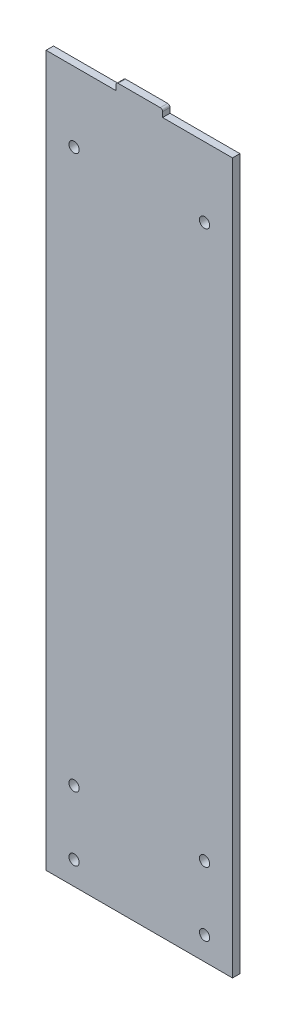
ISO-10303-21;
HEADER;
FILE_DESCRIPTION(('STEP AP214'),'2;1');
FILE_NAME('part.step','',(''),(''),'','','');
FILE_SCHEMA(('AUTOMOTIVE_DESIGN { 1 0 10303 214 1 1 1 1 }'));
ENDSEC;
DATA;
#1=APPLICATION_CONTEXT('core data for automotive mechanical design processes');
#2=APPLICATION_PROTOCOL_DEFINITION('international standard','automotive_design',2000,#1);
#3=PRODUCT_CONTEXT('',#1,'mechanical');
#4=PRODUCT('Part','Part','',(#3));
#5=PRODUCT_RELATED_PRODUCT_CATEGORY('part','',(#4));
#6=PRODUCT_DEFINITION_FORMATION('','',#4);
#7=PRODUCT_DEFINITION_CONTEXT('part definition',#1,'design');
#8=PRODUCT_DEFINITION('design','',#6,#7);
#9=PRODUCT_DEFINITION_SHAPE('','',#8);
#10=(LENGTH_UNIT() NAMED_UNIT(*) SI_UNIT(.MILLI.,.METRE.));
#11=(NAMED_UNIT(*) PLANE_ANGLE_UNIT() SI_UNIT($,.RADIAN.));
#12=(NAMED_UNIT(*) SI_UNIT($,.STERADIAN.) SOLID_ANGLE_UNIT());
#13=UNCERTAINTY_MEASURE_WITH_UNIT(LENGTH_MEASURE(1.E-05),#10,'distance_accuracy_value','');
#14=(GEOMETRIC_REPRESENTATION_CONTEXT(3) GLOBAL_UNCERTAINTY_ASSIGNED_CONTEXT((#13)) GLOBAL_UNIT_ASSIGNED_CONTEXT((#10,
#11,#12)) REPRESENTATION_CONTEXT('',''));
#15=CARTESIAN_POINT('',(0.,0.,0.));
#16=DIRECTION('',(0.,0.,1.));
#17=DIRECTION('',(1.,0.,0.));
#18=AXIS2_PLACEMENT_3D('',#15,#16,#17);
#19=CARTESIAN_POINT('',(-40.,152.4,3.175));
#20=DIRECTION('',(0.,-1.,0.));
#21=DIRECTION('',(0.,0.,-1.));
#22=AXIS2_PLACEMENT_3D('',#19,#20,#21);
#23=PLANE('',#22);
#24=DIRECTION('',(0.,0.,-1.));
#25=VECTOR('',#24,1.);
#26=CARTESIAN_POINT('',(10.,152.4,3.175));
#27=LINE('',#26,#25);
#28=CARTESIAN_POINT('',(10.,152.4,3.175));
#29=VERTEX_POINT('',#28);
#30=CARTESIAN_POINT('',(10.,152.4,0.));
#31=VERTEX_POINT('',#30);
#32=EDGE_CURVE('E148',#29,#31,#27,.T.);
#33=ORIENTED_EDGE('',*,*,#32,.F.);
#34=DIRECTION('',(-1.,0.,0.));
#35=VECTOR('',#34,1.);
#36=CARTESIAN_POINT('',(-40.,152.4,3.175));
#37=LINE('',#36,#35);
#38=CARTESIAN_POINT('',(40.,152.4,3.175));
#39=VERTEX_POINT('',#38);
#40=EDGE_CURVE('E141',#39,#29,#37,.T.);
#41=ORIENTED_EDGE('',*,*,#40,.F.);
#42=DIRECTION('',(0.,0.,-1.));
#43=VECTOR('',#42,1.);
#44=CARTESIAN_POINT('',(40.,152.4,3.175));
#45=LINE('',#44,#43);
#46=CARTESIAN_POINT('',(40.,152.4,0.));
#47=VERTEX_POINT('',#46);
#48=EDGE_CURVE('E250',#39,#47,#45,.T.);
#49=ORIENTED_EDGE('',*,*,#48,.T.);
#50=DIRECTION('',(-1.,0.,0.));
#51=VECTOR('',#50,1.);
#52=CARTESIAN_POINT('',(-40.,152.4,0.));
#53=LINE('',#52,#51);
#54=EDGE_CURVE('E232',#47,#31,#53,.T.);
#55=ORIENTED_EDGE('',*,*,#54,.T.);
#56=EDGE_LOOP('',(#33,#41,#49,#55));
#57=FACE_BOUND('',#56,.T.);
#58=ADVANCED_FACE('F45',(#57),#23,.F.);
#59=DIRECTION('',(0.,0.,1.));
#60=VECTOR('',#59,1.);
#61=CARTESIAN_POINT('',(-10.,152.4,3.175));
#62=LINE('',#61,#60);
#63=CARTESIAN_POINT('',(-10.,152.4,0.));
#64=VERTEX_POINT('',#63);
#65=CARTESIAN_POINT('',(-10.,152.4,3.175));
#66=VERTEX_POINT('',#65);
#67=EDGE_CURVE('E135',#64,#66,#62,.T.);
#68=ORIENTED_EDGE('',*,*,#67,.F.);
#69=CARTESIAN_POINT('',(-40.,152.4,0.));
#70=VERTEX_POINT('',#69);
#71=EDGE_CURVE('E231',#64,#70,#53,.T.);
#72=ORIENTED_EDGE('',*,*,#71,.T.);
#73=DIRECTION('',(0.,0.,-1.));
#74=VECTOR('',#73,1.);
#75=CARTESIAN_POINT('',(-40.,152.4,3.175));
#76=LINE('',#75,#74);
#77=CARTESIAN_POINT('',(-40.,152.4,3.175));
#78=VERTEX_POINT('',#77);
#79=EDGE_CURVE('E138',#78,#70,#76,.T.);
#80=ORIENTED_EDGE('',*,*,#79,.F.);
#81=EDGE_CURVE('E123',#66,#78,#37,.T.);
#82=ORIENTED_EDGE('',*,*,#81,.F.);
#83=EDGE_LOOP('',(#68,#72,#80,#82));
#84=FACE_BOUND('',#83,.T.);
#85=ADVANCED_FACE('F134',(#84),#23,.F.);
#86=CARTESIAN_POINT('',(40.,-152.4,3.175));
#87=DIRECTION('',(-1.,0.,0.));
#88=DIRECTION('',(0.,0.,1.));
#89=AXIS2_PLACEMENT_3D('',#86,#87,#88);
#90=PLANE('',#89);
#91=DIRECTION('',(0.,1.,0.));
#92=VECTOR('',#91,1.);
#93=CARTESIAN_POINT('',(40.,-152.4,0.));
#94=LINE('',#93,#92);
#95=CARTESIAN_POINT('',(40.,-152.4,0.));
#96=VERTEX_POINT('',#95);
#97=EDGE_CURVE('E211',#96,#47,#94,.T.);
#98=ORIENTED_EDGE('',*,*,#97,.T.);
#99=ORIENTED_EDGE('',*,*,#48,.F.);
#100=DIRECTION('',(0.,1.,0.));
#101=VECTOR('',#100,1.);
#102=CARTESIAN_POINT('',(40.,-152.4,3.175));
#103=LINE('',#102,#101);
#104=CARTESIAN_POINT('',(40.,-152.4,3.175));
#105=VERTEX_POINT('',#104);
#106=EDGE_CURVE('E142',#105,#39,#103,.T.);
#107=ORIENTED_EDGE('',*,*,#106,.F.);
#108=DIRECTION('',(0.,0.,-1.));
#109=VECTOR('',#108,1.);
#110=CARTESIAN_POINT('',(40.,-152.4,3.175));
#111=LINE('',#110,#109);
#112=EDGE_CURVE('E227',#105,#96,#111,.T.);
#113=ORIENTED_EDGE('',*,*,#112,.T.);
#114=EDGE_LOOP('',(#98,#99,#107,#113));
#115=FACE_BOUND('',#114,.T.);
#116=ADVANCED_FACE('F292',(#115),#90,.F.);
#117=CARTESIAN_POINT('',(-40.,-152.4,3.175));
#118=DIRECTION('',(1.,0.,0.));
#119=DIRECTION('',(0.,0.,-1.));
#120=AXIS2_PLACEMENT_3D('',#117,#118,#119);
#121=PLANE('',#120);
#122=DIRECTION('',(0.,-1.,0.));
#123=VECTOR('',#122,1.);
#124=CARTESIAN_POINT('',(-40.,-152.4,0.));
#125=LINE('',#124,#123);
#126=CARTESIAN_POINT('',(-40.,-152.4,0.));
#127=VERTEX_POINT('',#126);
#128=EDGE_CURVE('E236',#70,#127,#125,.T.);
#129=ORIENTED_EDGE('',*,*,#128,.T.);
#130=DIRECTION('',(0.,0.,-1.));
#131=VECTOR('',#130,1.);
#132=CARTESIAN_POINT('',(-40.,-152.4,3.175));
#133=LINE('',#132,#131);
#134=CARTESIAN_POINT('',(-40.,-152.4,3.175));
#135=VERTEX_POINT('',#134);
#136=EDGE_CURVE('E244',#135,#127,#133,.T.);
#137=ORIENTED_EDGE('',*,*,#136,.F.);
#138=DIRECTION('',(0.,-1.,0.));
#139=VECTOR('',#138,1.);
#140=CARTESIAN_POINT('',(-40.,-152.4,3.175));
#141=LINE('',#140,#139);
#142=EDGE_CURVE('E221',#78,#135,#141,.T.);
#143=ORIENTED_EDGE('',*,*,#142,.F.);
#144=ORIENTED_EDGE('',*,*,#79,.T.);
#145=EDGE_LOOP('',(#129,#137,#143,#144));
#146=FACE_BOUND('',#145,.T.);
#147=ADVANCED_FACE('F300',(#146),#121,.F.);
#148=CARTESIAN_POINT('',(-40.,-152.4,3.175));
#149=DIRECTION('',(0.,1.,0.));
#150=DIRECTION('',(0.,0.,1.));
#151=AXIS2_PLACEMENT_3D('',#148,#149,#150);
#152=PLANE('',#151);
#153=DIRECTION('',(1.,0.,0.));
#154=VECTOR('',#153,1.);
#155=CARTESIAN_POINT('',(-40.,-152.4,0.));
#156=LINE('',#155,#154);
#157=EDGE_CURVE('E217',#127,#96,#156,.T.);
#158=ORIENTED_EDGE('',*,*,#157,.T.);
#159=ORIENTED_EDGE('',*,*,#112,.F.);
#160=DIRECTION('',(1.,0.,0.));
#161=VECTOR('',#160,1.);
#162=CARTESIAN_POINT('',(-40.,-152.4,3.175));
#163=LINE('',#162,#161);
#164=EDGE_CURVE('E224',#135,#105,#163,.T.);
#165=ORIENTED_EDGE('',*,*,#164,.F.);
#166=ORIENTED_EDGE('',*,*,#136,.T.);
#167=EDGE_LOOP('',(#158,#159,#165,#166));
#168=FACE_BOUND('',#167,.T.);
#169=ADVANCED_FACE('F297',(#168),#152,.F.);
#170=CARTESIAN_POINT('',(0.,0.,3.175));
#171=DIRECTION('',(0.,0.,-1.));
#172=DIRECTION('',(-1.,0.,0.));
#173=AXIS2_PLACEMENT_3D('',#170,#171,#172);
#174=PLANE('',#173);
#175=CARTESIAN_POINT('',(28.,-114.9,3.175));
#176=DIRECTION('',(0.,0.,1.));
#177=DIRECTION('',(-1.,0.,0.));
#178=AXIS2_PLACEMENT_3D('',#175,#176,#177);
#179=CIRCLE('',#178,2.2);
#180=CARTESIAN_POINT('',(25.8,-114.9,3.175));
#181=VERTEX_POINT('',#180);
#182=EDGE_CURVE('E175',#181,#181,#179,.T.);
#183=ORIENTED_EDGE('',*,*,#182,.F.);
#184=EDGE_LOOP('',(#183));
#185=FACE_BOUND('',#184,.T.);
#186=CARTESIAN_POINT('',(28.,-142.4,3.175));
#187=DIRECTION('',(0.,0.,1.));
#188=DIRECTION('',(1.,0.,0.));
#189=AXIS2_PLACEMENT_3D('',#186,#187,#188);
#190=CIRCLE('',#189,2.2);
#191=CARTESIAN_POINT('',(30.2,-142.4,3.175));
#192=VERTEX_POINT('',#191);
#193=EDGE_CURVE('E184',#192,#192,#190,.T.);
#194=ORIENTED_EDGE('',*,*,#193,.F.);
#195=EDGE_LOOP('',(#194));
#196=FACE_BOUND('',#195,.T.);
#197=CARTESIAN_POINT('',(-28.,-142.4,3.175));
#198=DIRECTION('',(0.,0.,1.));
#199=DIRECTION('',(-1.,0.,0.));
#200=AXIS2_PLACEMENT_3D('',#197,#198,#199);
#201=CIRCLE('',#200,2.2);
#202=CARTESIAN_POINT('',(-30.2,-142.4,3.175));
#203=VERTEX_POINT('',#202);
#204=EDGE_CURVE('E192',#203,#203,#201,.T.);
#205=ORIENTED_EDGE('',*,*,#204,.F.);
#206=EDGE_LOOP('',(#205));
#207=FACE_BOUND('',#206,.T.);
#208=CARTESIAN_POINT('',(-28.,122.4,3.175));
#209=DIRECTION('',(0.,0.,1.));
#210=DIRECTION('',(1.,0.,0.));
#211=AXIS2_PLACEMENT_3D('',#208,#209,#210);
#212=CIRCLE('',#211,2.20000000000001);
#213=CARTESIAN_POINT('',(-25.8,122.4,3.175));
#214=VERTEX_POINT('',#213);
#215=EDGE_CURVE('E200',#214,#214,#212,.T.);
#216=ORIENTED_EDGE('',*,*,#215,.F.);
#217=EDGE_LOOP('',(#216));
#218=FACE_BOUND('',#217,.T.);
#219=CARTESIAN_POINT('',(28.,122.4,3.175));
#220=DIRECTION('',(0.,0.,1.));
#221=DIRECTION('',(-1.,0.,0.));
#222=AXIS2_PLACEMENT_3D('',#219,#220,#221);
#223=CIRCLE('',#222,2.20000000000001);
#224=CARTESIAN_POINT('',(25.8,122.4,3.175));
#225=VERTEX_POINT('',#224);
#226=EDGE_CURVE('E167',#225,#225,#223,.T.);
#227=ORIENTED_EDGE('',*,*,#226,.F.);
#228=EDGE_LOOP('',(#227));
#229=FACE_BOUND('',#228,.T.);
#230=CARTESIAN_POINT('',(-28.,-114.9,3.175));
#231=DIRECTION('',(0.,0.,1.));
#232=DIRECTION('',(1.,0.,0.));
#233=AXIS2_PLACEMENT_3D('',#230,#231,#232);
#234=CIRCLE('',#233,2.2);
#235=CARTESIAN_POINT('',(-25.8,-114.9,3.175));
#236=VERTEX_POINT('',#235);
#237=EDGE_CURVE('E179',#236,#236,#234,.T.);
#238=ORIENTED_EDGE('',*,*,#237,.F.);
#239=EDGE_LOOP('',(#238));
#240=FACE_BOUND('',#239,.T.);
#241=DIRECTION('',(0.,-1.,0.));
#242=VECTOR('',#241,1.);
#243=CARTESIAN_POINT('',(10.,155.575,3.175));
#244=LINE('',#243,#242);
#245=CARTESIAN_POINT('',(10.,154.575,3.175));
#246=VERTEX_POINT('',#245);
#247=EDGE_CURVE('E130',#246,#29,#244,.T.);
#248=ORIENTED_EDGE('',*,*,#247,.F.);
#249=CARTESIAN_POINT('',(9.,154.575,3.175));
#250=DIRECTION('',(0.,0.,-1.));
#251=DIRECTION('',(-1.,0.,0.));
#252=AXIS2_PLACEMENT_3D('',#249,#250,#251);
#253=CIRCLE('',#252,1.);
#254=CARTESIAN_POINT('',(9.,155.575,3.175));
#255=VERTEX_POINT('',#254);
#256=EDGE_CURVE('E54',#246,#255,#253,.F.);
#257=ORIENTED_EDGE('',*,*,#256,.T.);
#258=DIRECTION('',(1.,0.,0.));
#259=VECTOR('',#258,1.);
#260=CARTESIAN_POINT('',(-10.,155.575,3.175));
#261=LINE('',#260,#259);
#262=CARTESIAN_POINT('',(-9.,155.575,3.175));
#263=VERTEX_POINT('',#262);
#264=EDGE_CURVE('E153',#263,#255,#261,.T.);
#265=ORIENTED_EDGE('',*,*,#264,.F.);
#266=CARTESIAN_POINT('',(-9.,154.575,3.175));
#267=DIRECTION('',(0.,0.,-1.));
#268=DIRECTION('',(-1.,0.,0.));
#269=AXIS2_PLACEMENT_3D('',#266,#267,#268);
#270=CIRCLE('',#269,1.);
#271=CARTESIAN_POINT('',(-10.,154.575,3.175));
#272=VERTEX_POINT('',#271);
#273=EDGE_CURVE('E61',#263,#272,#270,.F.);
#274=ORIENTED_EDGE('',*,*,#273,.T.);
#275=DIRECTION('',(0.,-1.,0.));
#276=VECTOR('',#275,1.);
#277=CARTESIAN_POINT('',(-10.,155.575,3.175));
#278=LINE('',#277,#276);
#279=EDGE_CURVE('E120',#272,#66,#278,.T.);
#280=ORIENTED_EDGE('',*,*,#279,.T.);
#281=ORIENTED_EDGE('',*,*,#81,.T.);
#282=ORIENTED_EDGE('',*,*,#142,.T.);
#283=ORIENTED_EDGE('',*,*,#164,.T.);
#284=ORIENTED_EDGE('',*,*,#106,.T.);
#285=ORIENTED_EDGE('',*,*,#40,.T.);
#286=EDGE_LOOP('',(#248,#257,#265,#274,#280,#281,#282,#283,#284,#285));
#287=FACE_BOUND('',#286,.T.);
#288=ADVANCED_FACE('F122',(#185,#196,#207,#218,#229,#240,#287),#174,.F.);
#289=CARTESIAN_POINT('',(0.,0.,0.));
#290=DIRECTION('',(0.,0.,-1.));
#291=DIRECTION('',(-1.,0.,0.));
#292=AXIS2_PLACEMENT_3D('',#289,#290,#291);
#293=PLANE('',#292);
#294=CARTESIAN_POINT('',(28.,-114.9,0.));
#295=DIRECTION('',(0.,0.,1.));
#296=DIRECTION('',(-1.,0.,0.));
#297=AXIS2_PLACEMENT_3D('',#294,#295,#296);
#298=CIRCLE('',#297,2.2);
#299=CARTESIAN_POINT('',(25.8,-114.9,0.));
#300=VERTEX_POINT('',#299);
#301=EDGE_CURVE('E180',#300,#300,#298,.T.);
#302=ORIENTED_EDGE('',*,*,#301,.T.);
#303=EDGE_LOOP('',(#302));
#304=FACE_BOUND('',#303,.T.);
#305=CARTESIAN_POINT('',(28.,-142.4,0.));
#306=DIRECTION('',(0.,0.,1.));
#307=DIRECTION('',(1.,0.,0.));
#308=AXIS2_PLACEMENT_3D('',#305,#306,#307);
#309=CIRCLE('',#308,2.2);
#310=CARTESIAN_POINT('',(30.2,-142.4,0.));
#311=VERTEX_POINT('',#310);
#312=EDGE_CURVE('E188',#311,#311,#309,.T.);
#313=ORIENTED_EDGE('',*,*,#312,.T.);
#314=EDGE_LOOP('',(#313));
#315=FACE_BOUND('',#314,.T.);
#316=CARTESIAN_POINT('',(-28.,-142.4,0.));
#317=DIRECTION('',(0.,0.,1.));
#318=DIRECTION('',(-1.,0.,0.));
#319=AXIS2_PLACEMENT_3D('',#316,#317,#318);
#320=CIRCLE('',#319,2.2);
#321=CARTESIAN_POINT('',(-30.2,-142.4,0.));
#322=VERTEX_POINT('',#321);
#323=EDGE_CURVE('E196',#322,#322,#320,.T.);
#324=ORIENTED_EDGE('',*,*,#323,.T.);
#325=EDGE_LOOP('',(#324));
#326=FACE_BOUND('',#325,.T.);
#327=CARTESIAN_POINT('',(-28.,122.4,0.));
#328=DIRECTION('',(0.,0.,1.));
#329=DIRECTION('',(1.,0.,0.));
#330=AXIS2_PLACEMENT_3D('',#327,#328,#329);
#331=CIRCLE('',#330,2.20000000000001);
#332=CARTESIAN_POINT('',(-25.8,122.4,0.));
#333=VERTEX_POINT('',#332);
#334=EDGE_CURVE('E171',#333,#333,#331,.T.);
#335=ORIENTED_EDGE('',*,*,#334,.T.);
#336=EDGE_LOOP('',(#335));
#337=FACE_BOUND('',#336,.T.);
#338=CARTESIAN_POINT('',(28.,122.4,0.));
#339=DIRECTION('',(0.,0.,1.));
#340=DIRECTION('',(-1.,0.,0.));
#341=AXIS2_PLACEMENT_3D('',#338,#339,#340);
#342=CIRCLE('',#341,2.20000000000001);
#343=CARTESIAN_POINT('',(25.8,122.4,0.));
#344=VERTEX_POINT('',#343);
#345=EDGE_CURVE('E166',#344,#344,#342,.T.);
#346=ORIENTED_EDGE('',*,*,#345,.T.);
#347=EDGE_LOOP('',(#346));
#348=FACE_BOUND('',#347,.T.);
#349=CARTESIAN_POINT('',(-28.,-114.9,0.));
#350=DIRECTION('',(0.,0.,1.));
#351=DIRECTION('',(1.,0.,0.));
#352=AXIS2_PLACEMENT_3D('',#349,#350,#351);
#353=CIRCLE('',#352,2.2);
#354=CARTESIAN_POINT('',(-25.8,-114.9,0.));
#355=VERTEX_POINT('',#354);
#356=EDGE_CURVE('E207',#355,#355,#353,.T.);
#357=ORIENTED_EDGE('',*,*,#356,.T.);
#358=EDGE_LOOP('',(#357));
#359=FACE_BOUND('',#358,.T.);
#360=DIRECTION('',(-1.,0.,0.));
#361=VECTOR('',#360,1.);
#362=CARTESIAN_POINT('',(-10.,155.575,0.));
#363=LINE('',#362,#361);
#364=CARTESIAN_POINT('',(9.,155.575,0.));
#365=VERTEX_POINT('',#364);
#366=CARTESIAN_POINT('',(-9.,155.575,0.));
#367=VERTEX_POINT('',#366);
#368=EDGE_CURVE('E147',#365,#367,#363,.T.);
#369=ORIENTED_EDGE('',*,*,#368,.F.);
#370=CARTESIAN_POINT('',(9.,154.575,0.));
#371=DIRECTION('',(0.,0.,-1.));
#372=DIRECTION('',(-1.,0.,0.));
#373=AXIS2_PLACEMENT_3D('',#370,#371,#372);
#374=CIRCLE('',#373,1.);
#375=CARTESIAN_POINT('',(10.,154.575,0.));
#376=VERTEX_POINT('',#375);
#377=EDGE_CURVE('E265',#365,#376,#374,.T.);
#378=ORIENTED_EDGE('',*,*,#377,.T.);
#379=DIRECTION('',(0.,-1.,0.));
#380=VECTOR('',#379,1.);
#381=CARTESIAN_POINT('',(10.,155.575,0.));
#382=LINE('',#381,#380);
#383=EDGE_CURVE('E163',#376,#31,#382,.T.);
#384=ORIENTED_EDGE('',*,*,#383,.T.);
#385=ORIENTED_EDGE('',*,*,#54,.F.);
#386=ORIENTED_EDGE('',*,*,#97,.F.);
#387=ORIENTED_EDGE('',*,*,#157,.F.);
#388=ORIENTED_EDGE('',*,*,#128,.F.);
#389=ORIENTED_EDGE('',*,*,#71,.F.);
#390=DIRECTION('',(0.,-1.,0.));
#391=VECTOR('',#390,1.);
#392=CARTESIAN_POINT('',(-10.,155.575,0.));
#393=LINE('',#392,#391);
#394=CARTESIAN_POINT('',(-10.,154.575,0.));
#395=VERTEX_POINT('',#394);
#396=EDGE_CURVE('E129',#395,#64,#393,.T.);
#397=ORIENTED_EDGE('',*,*,#396,.F.);
#398=CARTESIAN_POINT('',(-9.,154.575,0.));
#399=DIRECTION('',(0.,0.,-1.));
#400=DIRECTION('',(-1.,0.,0.));
#401=AXIS2_PLACEMENT_3D('',#398,#399,#400);
#402=CIRCLE('',#401,1.);
#403=EDGE_CURVE('E262',#395,#367,#402,.T.);
#404=ORIENTED_EDGE('',*,*,#403,.T.);
#405=EDGE_LOOP('',(#369,#378,#384,#385,#386,#387,#388,#389,#397,#404));
#406=FACE_BOUND('',#405,.T.);
#407=ADVANCED_FACE('F283',(#304,#315,#326,#337,#348,#359,#406),#293,.T.);
#408=CARTESIAN_POINT('',(-28.,-114.9,0.));
#409=DIRECTION('',(0.,0.,1.));
#410=DIRECTION('',(1.,0.,0.));
#411=AXIS2_PLACEMENT_3D('',#408,#409,#410);
#412=CYLINDRICAL_SURFACE('',#411,2.2);
#413=ORIENTED_EDGE('',*,*,#356,.F.);
#414=EDGE_LOOP('',(#413));
#415=FACE_BOUND('',#414,.T.);
#416=ORIENTED_EDGE('',*,*,#237,.T.);
#417=EDGE_LOOP('',(#416));
#418=FACE_BOUND('',#417,.T.);
#419=ADVANCED_FACE('F334',(#415,#418),#412,.F.);
#420=CARTESIAN_POINT('',(28.,122.4,0.));
#421=DIRECTION('',(0.,0.,1.));
#422=DIRECTION('',(1.,0.,0.));
#423=AXIS2_PLACEMENT_3D('',#420,#421,#422);
#424=CYLINDRICAL_SURFACE('',#423,2.20000000000001);
#425=ORIENTED_EDGE('',*,*,#345,.F.);
#426=EDGE_LOOP('',(#425));
#427=FACE_BOUND('',#426,.T.);
#428=ORIENTED_EDGE('',*,*,#226,.T.);
#429=EDGE_LOOP('',(#428));
#430=FACE_BOUND('',#429,.T.);
#431=ADVANCED_FACE('F330',(#427,#430),#424,.F.);
#432=CARTESIAN_POINT('',(-28.,122.4,0.));
#433=DIRECTION('',(0.,0.,1.));
#434=DIRECTION('',(1.,0.,0.));
#435=AXIS2_PLACEMENT_3D('',#432,#433,#434);
#436=CYLINDRICAL_SURFACE('',#435,2.20000000000001);
#437=ORIENTED_EDGE('',*,*,#334,.F.);
#438=EDGE_LOOP('',(#437));
#439=FACE_BOUND('',#438,.T.);
#440=ORIENTED_EDGE('',*,*,#215,.T.);
#441=EDGE_LOOP('',(#440));
#442=FACE_BOUND('',#441,.T.);
#443=ADVANCED_FACE('F333',(#439,#442),#436,.F.);
#444=CARTESIAN_POINT('',(-28.,-142.4,0.));
#445=DIRECTION('',(0.,0.,1.));
#446=DIRECTION('',(1.,0.,0.));
#447=AXIS2_PLACEMENT_3D('',#444,#445,#446);
#448=CYLINDRICAL_SURFACE('',#447,2.2);
#449=ORIENTED_EDGE('',*,*,#323,.F.);
#450=EDGE_LOOP('',(#449));
#451=FACE_BOUND('',#450,.T.);
#452=ORIENTED_EDGE('',*,*,#204,.T.);
#453=EDGE_LOOP('',(#452));
#454=FACE_BOUND('',#453,.T.);
#455=ADVANCED_FACE('F341',(#451,#454),#448,.F.);
#456=CARTESIAN_POINT('',(28.,-142.4,0.));
#457=DIRECTION('',(0.,0.,1.));
#458=DIRECTION('',(1.,0.,0.));
#459=AXIS2_PLACEMENT_3D('',#456,#457,#458);
#460=CYLINDRICAL_SURFACE('',#459,2.2);
#461=ORIENTED_EDGE('',*,*,#312,.F.);
#462=EDGE_LOOP('',(#461));
#463=FACE_BOUND('',#462,.T.);
#464=ORIENTED_EDGE('',*,*,#193,.T.);
#465=EDGE_LOOP('',(#464));
#466=FACE_BOUND('',#465,.T.);
#467=ADVANCED_FACE('F337',(#463,#466),#460,.F.);
#468=CARTESIAN_POINT('',(28.,-114.9,0.));
#469=DIRECTION('',(0.,0.,1.));
#470=DIRECTION('',(1.,0.,0.));
#471=AXIS2_PLACEMENT_3D('',#468,#469,#470);
#472=CYLINDRICAL_SURFACE('',#471,2.2);
#473=ORIENTED_EDGE('',*,*,#301,.F.);
#474=EDGE_LOOP('',(#473));
#475=FACE_BOUND('',#474,.T.);
#476=ORIENTED_EDGE('',*,*,#182,.T.);
#477=EDGE_LOOP('',(#476));
#478=FACE_BOUND('',#477,.T.);
#479=ADVANCED_FACE('F329',(#475,#478),#472,.F.);
#480=CARTESIAN_POINT('',(10.,155.575,3.175));
#481=DIRECTION('',(-1.,0.,0.));
#482=DIRECTION('',(0.,0.,1.));
#483=AXIS2_PLACEMENT_3D('',#480,#481,#482);
#484=PLANE('',#483);
#485=ORIENTED_EDGE('',*,*,#383,.F.);
#486=DIRECTION('',(0.,0.,-1.));
#487=VECTOR('',#486,1.);
#488=CARTESIAN_POINT('',(10.,154.575,3.175));
#489=LINE('',#488,#487);
#490=EDGE_CURVE('E69',#376,#246,#489,.F.);
#491=ORIENTED_EDGE('',*,*,#490,.T.);
#492=ORIENTED_EDGE('',*,*,#247,.T.);
#493=ORIENTED_EDGE('',*,*,#32,.T.);
#494=EDGE_LOOP('',(#485,#491,#492,#493));
#495=FACE_BOUND('',#494,.T.);
#496=ADVANCED_FACE('F284',(#495),#484,.F.);
#497=CARTESIAN_POINT('',(-10.,155.575,3.175));
#498=DIRECTION('',(1.,0.,0.));
#499=DIRECTION('',(0.,0.,-1.));
#500=AXIS2_PLACEMENT_3D('',#497,#498,#499);
#501=PLANE('',#500);
#502=ORIENTED_EDGE('',*,*,#279,.F.);
#503=DIRECTION('',(0.,0.,1.));
#504=VECTOR('',#503,1.);
#505=CARTESIAN_POINT('',(-10.,154.575,3.175));
#506=LINE('',#505,#504);
#507=EDGE_CURVE('E11',#272,#395,#506,.F.);
#508=ORIENTED_EDGE('',*,*,#507,.T.);
#509=ORIENTED_EDGE('',*,*,#396,.T.);
#510=ORIENTED_EDGE('',*,*,#67,.T.);
#511=EDGE_LOOP('',(#502,#508,#509,#510));
#512=FACE_BOUND('',#511,.T.);
#513=ADVANCED_FACE('F144',(#512),#501,.F.);
#514=CARTESIAN_POINT('',(0.,155.575,0.));
#515=DIRECTION('',(0.,-1.,0.));
#516=DIRECTION('',(0.,0.,-1.));
#517=AXIS2_PLACEMENT_3D('',#514,#515,#516);
#518=PLANE('',#517);
#519=ORIENTED_EDGE('',*,*,#264,.T.);
#520=DIRECTION('',(0.,0.,-1.));
#521=VECTOR('',#520,1.);
#522=CARTESIAN_POINT('',(9.,155.575,0.));
#523=LINE('',#522,#521);
#524=EDGE_CURVE('E258',#255,#365,#523,.T.);
#525=ORIENTED_EDGE('',*,*,#524,.T.);
#526=ORIENTED_EDGE('',*,*,#368,.T.);
#527=DIRECTION('',(0.,0.,1.));
#528=VECTOR('',#527,1.);
#529=CARTESIAN_POINT('',(-9.,155.575,0.));
#530=LINE('',#529,#528);
#531=EDGE_CURVE('E254',#367,#263,#530,.T.);
#532=ORIENTED_EDGE('',*,*,#531,.T.);
#533=EDGE_LOOP('',(#519,#525,#526,#532));
#534=FACE_BOUND('',#533,.T.);
#535=ADVANCED_FACE('F277',(#534),#518,.F.);
#536=CARTESIAN_POINT('',(9.,154.575,0.));
#537=DIRECTION('',(0.,0.,-1.));
#538=DIRECTION('',(-1.,0.,0.));
#539=AXIS2_PLACEMENT_3D('',#536,#537,#538);
#540=CYLINDRICAL_SURFACE('',#539,1.);
#541=ORIENTED_EDGE('',*,*,#256,.F.);
#542=ORIENTED_EDGE('',*,*,#490,.F.);
#543=ORIENTED_EDGE('',*,*,#377,.F.);
#544=ORIENTED_EDGE('',*,*,#524,.F.);
#545=EDGE_LOOP('',(#541,#542,#543,#544));
#546=FACE_BOUND('',#545,.T.);
#547=ADVANCED_FACE('F281',(#546),#540,.T.);
#548=CARTESIAN_POINT('',(-9.,154.575,0.));
#549=DIRECTION('',(0.,0.,1.));
#550=DIRECTION('',(1.,0.,0.));
#551=AXIS2_PLACEMENT_3D('',#548,#549,#550);
#552=CYLINDRICAL_SURFACE('',#551,1.);
#553=ORIENTED_EDGE('',*,*,#403,.F.);
#554=ORIENTED_EDGE('',*,*,#507,.F.);
#555=ORIENTED_EDGE('',*,*,#273,.F.);
#556=ORIENTED_EDGE('',*,*,#531,.F.);
#557=EDGE_LOOP('',(#553,#554,#555,#556));
#558=FACE_BOUND('',#557,.T.);
#559=ADVANCED_FACE('F47',(#558),#552,.T.);
#560=CLOSED_SHELL('',(#58,#85,#116,#147,#169,#288,#407,#419,#431,#443,#455,#467,#479,#496,#513,
#535,#547,#559));
#561=MANIFOLD_SOLID_BREP('B2',#560);
#562=ADVANCED_BREP_SHAPE_REPRESENTATION('',(#18,#561),#14);
#563=SHAPE_DEFINITION_REPRESENTATION(#9,#562);
ENDSEC;
END-ISO-10303-21;
